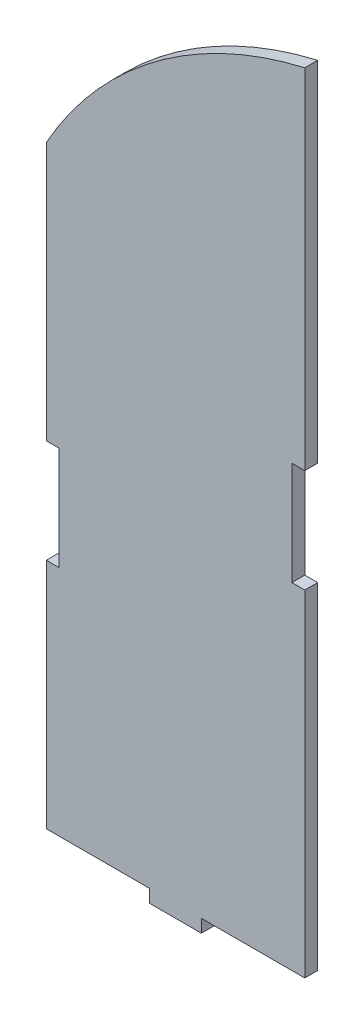
ISO-10303-21;
HEADER;
FILE_DESCRIPTION(('STEP AP214'),'2;1');
FILE_NAME('part.step','',(''),(''),'','','');
FILE_SCHEMA(('AUTOMOTIVE_DESIGN { 1 0 10303 214 1 1 1 1 }'));
ENDSEC;
DATA;
#1=APPLICATION_CONTEXT('core data for automotive mechanical design processes');
#2=APPLICATION_PROTOCOL_DEFINITION('international standard','automotive_design',2000,#1);
#3=PRODUCT_CONTEXT('',#1,'mechanical');
#4=PRODUCT('Part','Part','',(#3));
#5=PRODUCT_RELATED_PRODUCT_CATEGORY('part','',(#4));
#6=PRODUCT_DEFINITION_FORMATION('','',#4);
#7=PRODUCT_DEFINITION_CONTEXT('part definition',#1,'design');
#8=PRODUCT_DEFINITION('design','',#6,#7);
#9=PRODUCT_DEFINITION_SHAPE('','',#8);
#10=(LENGTH_UNIT() NAMED_UNIT(*) SI_UNIT(.MILLI.,.METRE.));
#11=(NAMED_UNIT(*) PLANE_ANGLE_UNIT() SI_UNIT($,.RADIAN.));
#12=(NAMED_UNIT(*) SI_UNIT($,.STERADIAN.) SOLID_ANGLE_UNIT());
#13=UNCERTAINTY_MEASURE_WITH_UNIT(LENGTH_MEASURE(1.E-05),#10,'distance_accuracy_value','');
#14=(GEOMETRIC_REPRESENTATION_CONTEXT(3) GLOBAL_UNCERTAINTY_ASSIGNED_CONTEXT((#13)) GLOBAL_UNIT_ASSIGNED_CONTEXT((#10,
#11,#12)) REPRESENTATION_CONTEXT('',''));
#15=CARTESIAN_POINT('',(0.,0.,0.));
#16=DIRECTION('',(0.,0.,1.));
#17=DIRECTION('',(1.,0.,0.));
#18=AXIS2_PLACEMENT_3D('',#15,#16,#17);
#19=CARTESIAN_POINT('',(99.9999999999915,315.707319284978,5.));
#20=DIRECTION('',(-1.,0.,0.));
#21=DIRECTION('',(0.,0.,1.));
#22=AXIS2_PLACEMENT_3D('',#19,#20,#21);
#23=PLANE('',#22);
#24=DIRECTION('',(0.,1.,0.));
#25=VECTOR('',#24,1.);
#26=CARTESIAN_POINT('',(99.9999999999915,315.707319284978,0.));
#27=LINE('',#26,#25);
#28=CARTESIAN_POINT('',(99.9999999999915,315.707319284978,0.));
#29=VERTEX_POINT('',#28);
#30=CARTESIAN_POINT('',(99.9999999999915,450.707319284978,0.));
#31=VERTEX_POINT('',#30);
#32=EDGE_CURVE('E179',#29,#31,#27,.T.);
#33=ORIENTED_EDGE('',*,*,#32,.T.);
#34=DIRECTION('',(0.,0.,-1.));
#35=VECTOR('',#34,1.);
#36=CARTESIAN_POINT('',(99.9999999999915,450.707319284978,5.));
#37=LINE('',#36,#35);
#38=CARTESIAN_POINT('',(99.9999999999915,450.707319284978,5.));
#39=VERTEX_POINT('',#38);
#40=EDGE_CURVE('E11',#39,#31,#37,.T.);
#41=ORIENTED_EDGE('',*,*,#40,.F.);
#42=DIRECTION('',(0.,1.,0.));
#43=VECTOR('',#42,1.);
#44=CARTESIAN_POINT('',(99.9999999999915,315.707319284978,5.));
#45=LINE('',#44,#43);
#46=CARTESIAN_POINT('',(99.9999999999915,315.707319284978,5.));
#47=VERTEX_POINT('',#46);
#48=EDGE_CURVE('E210',#47,#39,#45,.T.);
#49=ORIENTED_EDGE('',*,*,#48,.F.);
#50=DIRECTION('',(0.,0.,-1.));
#51=VECTOR('',#50,1.);
#52=CARTESIAN_POINT('',(99.9999999999915,315.707319284978,5.));
#53=LINE('',#52,#51);
#54=EDGE_CURVE('E175',#47,#29,#53,.T.);
#55=ORIENTED_EDGE('',*,*,#54,.T.);
#56=EDGE_LOOP('',(#33,#41,#49,#55));
#57=FACE_BOUND('',#56,.T.);
#58=ADVANCED_FACE('F35',(#57),#23,.F.);
#59=CARTESIAN_POINT('',(134.76828016419,300.182945732729,5.));
#60=DIRECTION('',(0.,0.,-1.));
#61=DIRECTION('',(-1.,0.,0.));
#62=AXIS2_PLACEMENT_3D('',#59,#60,#61);
#63=CYLINDRICAL_SURFACE('',#62,154.487605777529);
#64=CARTESIAN_POINT('',(134.76828016419,300.182945732729,0.));
#65=DIRECTION('',(0.,0.,1.));
#66=DIRECTION('',(-1.,0.,0.));
#67=AXIS2_PLACEMENT_3D('',#64,#65,#66);
#68=CIRCLE('',#67,154.487605777529);
#69=CARTESIAN_POINT('',(0.,375.707319284978,0.));
#70=VERTEX_POINT('',#69);
#71=EDGE_CURVE('E182',#31,#70,#68,.T.);
#72=ORIENTED_EDGE('',*,*,#71,.T.);
#73=DIRECTION('',(0.,0.,-1.));
#74=VECTOR('',#73,1.);
#75=CARTESIAN_POINT('',(0.,375.707319284978,5.));
#76=LINE('',#75,#74);
#77=CARTESIAN_POINT('',(0.,375.707319284978,5.));
#78=VERTEX_POINT('',#77);
#79=EDGE_CURVE('E43',#78,#70,#76,.T.);
#80=ORIENTED_EDGE('',*,*,#79,.F.);
#81=CARTESIAN_POINT('',(134.76828016419,300.182945732729,5.));
#82=DIRECTION('',(0.,0.,1.));
#83=DIRECTION('',(-1.,0.,0.));
#84=AXIS2_PLACEMENT_3D('',#81,#82,#83);
#85=CIRCLE('',#84,154.487605777529);
#86=EDGE_CURVE('E118',#39,#78,#85,.T.);
#87=ORIENTED_EDGE('',*,*,#86,.F.);
#88=ORIENTED_EDGE('',*,*,#40,.T.);
#89=EDGE_LOOP('',(#72,#80,#87,#88));
#90=FACE_BOUND('',#89,.T.);
#91=ADVANCED_FACE('F307',(#90),#63,.T.);
#92=CARTESIAN_POINT('',(0.,275.707319284978,5.));
#93=DIRECTION('',(1.,0.,0.));
#94=DIRECTION('',(0.,1.,0.));
#95=AXIS2_PLACEMENT_3D('',#92,#93,#94);
#96=PLANE('',#95);
#97=DIRECTION('',(0.,-1.,0.));
#98=VECTOR('',#97,1.);
#99=CARTESIAN_POINT('',(0.,275.707319284978,0.));
#100=LINE('',#99,#98);
#101=CARTESIAN_POINT('',(0.,275.707319284978,0.));
#102=VERTEX_POINT('',#101);
#103=EDGE_CURVE('E184',#70,#102,#100,.T.);
#104=ORIENTED_EDGE('',*,*,#103,.T.);
#105=DIRECTION('',(0.,0.,-1.));
#106=VECTOR('',#105,1.);
#107=CARTESIAN_POINT('',(0.,275.707319284978,5.));
#108=LINE('',#107,#106);
#109=CARTESIAN_POINT('',(0.,275.707319284978,5.));
#110=VERTEX_POINT('',#109);
#111=EDGE_CURVE('E241',#110,#102,#108,.T.);
#112=ORIENTED_EDGE('',*,*,#111,.F.);
#113=DIRECTION('',(0.,-1.,0.));
#114=VECTOR('',#113,1.);
#115=CARTESIAN_POINT('',(0.,275.707319284978,5.));
#116=LINE('',#115,#114);
#117=EDGE_CURVE('E249',#78,#110,#116,.T.);
#118=ORIENTED_EDGE('',*,*,#117,.F.);
#119=ORIENTED_EDGE('',*,*,#79,.T.);
#120=EDGE_LOOP('',(#104,#112,#118,#119));
#121=FACE_BOUND('',#120,.T.);
#122=ADVANCED_FACE('F247',(#121),#96,.F.);
#123=CARTESIAN_POINT('',(0.,275.707319284978,5.));
#124=DIRECTION('',(0.,1.,0.));
#125=DIRECTION('',(0.,0.,1.));
#126=AXIS2_PLACEMENT_3D('',#123,#124,#125);
#127=PLANE('',#126);
#128=DIRECTION('',(1.,0.,0.));
#129=VECTOR('',#128,1.);
#130=CARTESIAN_POINT('',(0.,275.707319284978,0.));
#131=LINE('',#130,#129);
#132=CARTESIAN_POINT('',(4.99999999999995,275.707319284978,0.));
#133=VERTEX_POINT('',#132);
#134=EDGE_CURVE('E186',#102,#133,#131,.T.);
#135=ORIENTED_EDGE('',*,*,#134,.T.);
#136=DIRECTION('',(0.,0.,-1.));
#137=VECTOR('',#136,1.);
#138=CARTESIAN_POINT('',(4.99999999999995,275.707319284978,5.));
#139=LINE('',#138,#137);
#140=CARTESIAN_POINT('',(4.99999999999995,275.707319284978,5.));
#141=VERTEX_POINT('',#140);
#142=EDGE_CURVE('E238',#141,#133,#139,.T.);
#143=ORIENTED_EDGE('',*,*,#142,.F.);
#144=DIRECTION('',(1.,0.,0.));
#145=VECTOR('',#144,1.);
#146=CARTESIAN_POINT('',(0.,275.707319284978,5.));
#147=LINE('',#146,#145);
#148=EDGE_CURVE('E267',#110,#141,#147,.T.);
#149=ORIENTED_EDGE('',*,*,#148,.F.);
#150=ORIENTED_EDGE('',*,*,#111,.T.);
#151=EDGE_LOOP('',(#135,#143,#149,#150));
#152=FACE_BOUND('',#151,.T.);
#153=ADVANCED_FACE('F258',(#152),#127,.F.);
#154=CARTESIAN_POINT('',(4.99999999999995,275.707319284978,5.));
#155=DIRECTION('',(1.,0.,0.));
#156=DIRECTION('',(0.,1.,0.));
#157=AXIS2_PLACEMENT_3D('',#154,#155,#156);
#158=PLANE('',#157);
#159=DIRECTION('',(0.,-1.,0.));
#160=VECTOR('',#159,1.);
#161=CARTESIAN_POINT('',(4.99999999999995,275.707319284978,0.));
#162=LINE('',#161,#160);
#163=CARTESIAN_POINT('',(4.99999999999997,235.707319284978,0.));
#164=VERTEX_POINT('',#163);
#165=EDGE_CURVE('E188',#133,#164,#162,.T.);
#166=ORIENTED_EDGE('',*,*,#165,.T.);
#167=DIRECTION('',(0.,0.,-1.));
#168=VECTOR('',#167,1.);
#169=CARTESIAN_POINT('',(4.99999999999997,235.707319284978,5.));
#170=LINE('',#169,#168);
#171=CARTESIAN_POINT('',(4.99999999999997,235.707319284978,5.));
#172=VERTEX_POINT('',#171);
#173=EDGE_CURVE('E235',#172,#164,#170,.T.);
#174=ORIENTED_EDGE('',*,*,#173,.F.);
#175=DIRECTION('',(0.,-1.,0.));
#176=VECTOR('',#175,1.);
#177=CARTESIAN_POINT('',(4.99999999999995,275.707319284978,5.));
#178=LINE('',#177,#176);
#179=EDGE_CURVE('E264',#141,#172,#178,.T.);
#180=ORIENTED_EDGE('',*,*,#179,.F.);
#181=ORIENTED_EDGE('',*,*,#142,.T.);
#182=EDGE_LOOP('',(#166,#174,#180,#181));
#183=FACE_BOUND('',#182,.T.);
#184=ADVANCED_FACE('F262',(#183),#158,.F.);
#185=CARTESIAN_POINT('',(4.99999999999997,235.707319284978,5.));
#186=DIRECTION('',(0.,-1.,0.));
#187=DIRECTION('',(0.,0.,-1.));
#188=AXIS2_PLACEMENT_3D('',#185,#186,#187);
#189=PLANE('',#188);
#190=DIRECTION('',(-1.,0.,0.));
#191=VECTOR('',#190,1.);
#192=CARTESIAN_POINT('',(4.99999999999997,235.707319284978,0.));
#193=LINE('',#192,#191);
#194=CARTESIAN_POINT('',(0.,235.707319284978,0.));
#195=VERTEX_POINT('',#194);
#196=EDGE_CURVE('E190',#164,#195,#193,.T.);
#197=ORIENTED_EDGE('',*,*,#196,.T.);
#198=DIRECTION('',(0.,0.,-1.));
#199=VECTOR('',#198,1.);
#200=CARTESIAN_POINT('',(0.,235.707319284978,5.));
#201=LINE('',#200,#199);
#202=CARTESIAN_POINT('',(0.,235.707319284978,5.));
#203=VERTEX_POINT('',#202);
#204=EDGE_CURVE('E232',#203,#195,#201,.T.);
#205=ORIENTED_EDGE('',*,*,#204,.F.);
#206=DIRECTION('',(-1.,0.,0.));
#207=VECTOR('',#206,1.);
#208=CARTESIAN_POINT('',(4.99999999999997,235.707319284978,5.));
#209=LINE('',#208,#207);
#210=EDGE_CURVE('E266',#172,#203,#209,.T.);
#211=ORIENTED_EDGE('',*,*,#210,.F.);
#212=ORIENTED_EDGE('',*,*,#173,.T.);
#213=EDGE_LOOP('',(#197,#205,#211,#212));
#214=FACE_BOUND('',#213,.T.);
#215=ADVANCED_FACE('F320',(#214),#189,.F.);
#216=CARTESIAN_POINT('',(0.,145.707319284978,5.));
#217=DIRECTION('',(1.,0.,0.));
#218=DIRECTION('',(0.,1.,0.));
#219=AXIS2_PLACEMENT_3D('',#216,#217,#218);
#220=PLANE('',#219);
#221=DIRECTION('',(0.,-1.,0.));
#222=VECTOR('',#221,1.);
#223=CARTESIAN_POINT('',(0.,145.707319284978,0.));
#224=LINE('',#223,#222);
#225=CARTESIAN_POINT('',(0.,145.707319284978,0.));
#226=VERTEX_POINT('',#225);
#227=EDGE_CURVE('E192',#195,#226,#224,.T.);
#228=ORIENTED_EDGE('',*,*,#227,.T.);
#229=DIRECTION('',(0.,0.,-1.));
#230=VECTOR('',#229,1.);
#231=CARTESIAN_POINT('',(0.,145.707319284978,5.));
#232=LINE('',#231,#230);
#233=CARTESIAN_POINT('',(0.,145.707319284978,5.));
#234=VERTEX_POINT('',#233);
#235=EDGE_CURVE('E229',#234,#226,#232,.T.);
#236=ORIENTED_EDGE('',*,*,#235,.F.);
#237=DIRECTION('',(0.,-1.,0.));
#238=VECTOR('',#237,1.);
#239=CARTESIAN_POINT('',(0.,145.707319284978,5.));
#240=LINE('',#239,#238);
#241=EDGE_CURVE('E269',#203,#234,#240,.T.);
#242=ORIENTED_EDGE('',*,*,#241,.F.);
#243=ORIENTED_EDGE('',*,*,#204,.T.);
#244=EDGE_LOOP('',(#228,#236,#242,#243));
#245=FACE_BOUND('',#244,.T.);
#246=ADVANCED_FACE('F323',(#245),#220,.F.);
#247=CARTESIAN_POINT('',(0.,145.707319284978,5.));
#248=DIRECTION('',(0.,1.,0.));
#249=DIRECTION('',(0.,0.,1.));
#250=AXIS2_PLACEMENT_3D('',#247,#248,#249);
#251=PLANE('',#250);
#252=DIRECTION('',(1.,0.,0.));
#253=VECTOR('',#252,1.);
#254=CARTESIAN_POINT('',(0.,145.707319284978,0.));
#255=LINE('',#254,#253);
#256=CARTESIAN_POINT('',(40.,145.707319284978,0.));
#257=VERTEX_POINT('',#256);
#258=EDGE_CURVE('E194',#226,#257,#255,.T.);
#259=ORIENTED_EDGE('',*,*,#258,.T.);
#260=DIRECTION('',(0.,0.,-1.));
#261=VECTOR('',#260,1.);
#262=CARTESIAN_POINT('',(40.,145.707319284978,5.));
#263=LINE('',#262,#261);
#264=CARTESIAN_POINT('',(40.,145.707319284978,5.));
#265=VERTEX_POINT('',#264);
#266=EDGE_CURVE('E226',#265,#257,#263,.T.);
#267=ORIENTED_EDGE('',*,*,#266,.F.);
#268=DIRECTION('',(1.,0.,0.));
#269=VECTOR('',#268,1.);
#270=CARTESIAN_POINT('',(0.,145.707319284978,5.));
#271=LINE('',#270,#269);
#272=EDGE_CURVE('E275',#234,#265,#271,.T.);
#273=ORIENTED_EDGE('',*,*,#272,.F.);
#274=ORIENTED_EDGE('',*,*,#235,.T.);
#275=EDGE_LOOP('',(#259,#267,#273,#274));
#276=FACE_BOUND('',#275,.T.);
#277=ADVANCED_FACE('F327',(#276),#251,.F.);
#278=CARTESIAN_POINT('',(40.,145.707319284978,5.));
#279=DIRECTION('',(1.,0.,0.));
#280=DIRECTION('',(0.,0.,-1.));
#281=AXIS2_PLACEMENT_3D('',#278,#279,#280);
#282=PLANE('',#281);
#283=DIRECTION('',(0.,-1.,0.));
#284=VECTOR('',#283,1.);
#285=CARTESIAN_POINT('',(40.,145.707319284978,0.));
#286=LINE('',#285,#284);
#287=CARTESIAN_POINT('',(40.,140.707319284978,0.));
#288=VERTEX_POINT('',#287);
#289=EDGE_CURVE('E196',#257,#288,#286,.T.);
#290=ORIENTED_EDGE('',*,*,#289,.T.);
#291=DIRECTION('',(0.,0.,-1.));
#292=VECTOR('',#291,1.);
#293=CARTESIAN_POINT('',(40.,140.707319284978,5.));
#294=LINE('',#293,#292);
#295=CARTESIAN_POINT('',(40.,140.707319284978,5.));
#296=VERTEX_POINT('',#295);
#297=EDGE_CURVE('E223',#296,#288,#294,.T.);
#298=ORIENTED_EDGE('',*,*,#297,.F.);
#299=DIRECTION('',(0.,-1.,0.));
#300=VECTOR('',#299,1.);
#301=CARTESIAN_POINT('',(40.,145.707319284978,5.));
#302=LINE('',#301,#300);
#303=EDGE_CURVE('E277',#265,#296,#302,.T.);
#304=ORIENTED_EDGE('',*,*,#303,.F.);
#305=ORIENTED_EDGE('',*,*,#266,.T.);
#306=EDGE_LOOP('',(#290,#298,#304,#305));
#307=FACE_BOUND('',#306,.T.);
#308=ADVANCED_FACE('F331',(#307),#282,.F.);
#309=CARTESIAN_POINT('',(40.,140.707319284978,5.));
#310=DIRECTION('',(0.,1.,0.));
#311=DIRECTION('',(0.,0.,1.));
#312=AXIS2_PLACEMENT_3D('',#309,#310,#311);
#313=PLANE('',#312);
#314=DIRECTION('',(1.,0.,0.));
#315=VECTOR('',#314,1.);
#316=CARTESIAN_POINT('',(40.,140.707319284978,0.));
#317=LINE('',#316,#315);
#318=CARTESIAN_POINT('',(60.,140.707319284978,0.));
#319=VERTEX_POINT('',#318);
#320=EDGE_CURVE('E198',#288,#319,#317,.T.);
#321=ORIENTED_EDGE('',*,*,#320,.T.);
#322=DIRECTION('',(0.,0.,-1.));
#323=VECTOR('',#322,1.);
#324=CARTESIAN_POINT('',(60.,140.707319284978,5.));
#325=LINE('',#324,#323);
#326=CARTESIAN_POINT('',(60.,140.707319284978,5.));
#327=VERTEX_POINT('',#326);
#328=EDGE_CURVE('E220',#327,#319,#325,.T.);
#329=ORIENTED_EDGE('',*,*,#328,.F.);
#330=DIRECTION('',(1.,0.,0.));
#331=VECTOR('',#330,1.);
#332=CARTESIAN_POINT('',(40.,140.707319284978,5.));
#333=LINE('',#332,#331);
#334=EDGE_CURVE('E279',#296,#327,#333,.T.);
#335=ORIENTED_EDGE('',*,*,#334,.F.);
#336=ORIENTED_EDGE('',*,*,#297,.T.);
#337=EDGE_LOOP('',(#321,#329,#335,#336));
#338=FACE_BOUND('',#337,.T.);
#339=ADVANCED_FACE('F335',(#338),#313,.F.);
#340=CARTESIAN_POINT('',(60.,140.707319284978,5.));
#341=DIRECTION('',(-1.,0.,0.));
#342=DIRECTION('',(0.,0.,1.));
#343=AXIS2_PLACEMENT_3D('',#340,#341,#342);
#344=PLANE('',#343);
#345=DIRECTION('',(0.,1.,0.));
#346=VECTOR('',#345,1.);
#347=CARTESIAN_POINT('',(60.,140.707319284978,0.));
#348=LINE('',#347,#346);
#349=CARTESIAN_POINT('',(60.,145.707319284978,0.));
#350=VERTEX_POINT('',#349);
#351=EDGE_CURVE('E200',#319,#350,#348,.T.);
#352=ORIENTED_EDGE('',*,*,#351,.T.);
#353=DIRECTION('',(0.,0.,-1.));
#354=VECTOR('',#353,1.);
#355=CARTESIAN_POINT('',(60.,145.707319284978,5.));
#356=LINE('',#355,#354);
#357=CARTESIAN_POINT('',(60.,145.707319284978,5.));
#358=VERTEX_POINT('',#357);
#359=EDGE_CURVE('E217',#358,#350,#356,.T.);
#360=ORIENTED_EDGE('',*,*,#359,.F.);
#361=DIRECTION('',(0.,1.,0.));
#362=VECTOR('',#361,1.);
#363=CARTESIAN_POINT('',(60.,140.707319284978,5.));
#364=LINE('',#363,#362);
#365=EDGE_CURVE('E281',#327,#358,#364,.T.);
#366=ORIENTED_EDGE('',*,*,#365,.F.);
#367=ORIENTED_EDGE('',*,*,#328,.T.);
#368=EDGE_LOOP('',(#352,#360,#366,#367));
#369=FACE_BOUND('',#368,.T.);
#370=ADVANCED_FACE('F339',(#369),#344,.F.);
#371=CARTESIAN_POINT('',(60.,145.707319284978,5.));
#372=DIRECTION('',(0.,1.,0.));
#373=DIRECTION('',(0.,0.,1.));
#374=AXIS2_PLACEMENT_3D('',#371,#372,#373);
#375=PLANE('',#374);
#376=DIRECTION('',(1.,0.,0.));
#377=VECTOR('',#376,1.);
#378=CARTESIAN_POINT('',(60.,145.707319284978,0.));
#379=LINE('',#378,#377);
#380=CARTESIAN_POINT('',(99.9999999999915,145.707319284978,0.));
#381=VERTEX_POINT('',#380);
#382=EDGE_CURVE('E202',#350,#381,#379,.T.);
#383=ORIENTED_EDGE('',*,*,#382,.T.);
#384=DIRECTION('',(0.,0.,-1.));
#385=VECTOR('',#384,1.);
#386=CARTESIAN_POINT('',(99.9999999999915,145.707319284978,5.));
#387=LINE('',#386,#385);
#388=CARTESIAN_POINT('',(99.9999999999915,145.707319284978,5.));
#389=VERTEX_POINT('',#388);
#390=EDGE_CURVE('E214',#389,#381,#387,.T.);
#391=ORIENTED_EDGE('',*,*,#390,.F.);
#392=DIRECTION('',(1.,0.,0.));
#393=VECTOR('',#392,1.);
#394=CARTESIAN_POINT('',(60.,145.707319284978,5.));
#395=LINE('',#394,#393);
#396=EDGE_CURVE('E283',#358,#389,#395,.T.);
#397=ORIENTED_EDGE('',*,*,#396,.F.);
#398=ORIENTED_EDGE('',*,*,#359,.T.);
#399=EDGE_LOOP('',(#383,#391,#397,#398));
#400=FACE_BOUND('',#399,.T.);
#401=ADVANCED_FACE('F289',(#400),#375,.F.);
#402=CARTESIAN_POINT('',(99.9999999999915,275.707319284978,5.));
#403=DIRECTION('',(-1.,0.,0.));
#404=DIRECTION('',(0.,0.,1.));
#405=AXIS2_PLACEMENT_3D('',#402,#403,#404);
#406=PLANE('',#405);
#407=DIRECTION('',(0.,1.,0.));
#408=VECTOR('',#407,1.);
#409=CARTESIAN_POINT('',(99.9999999999915,275.707319284978,0.));
#410=LINE('',#409,#408);
#411=CARTESIAN_POINT('',(99.9999999999915,275.707319284978,0.));
#412=VERTEX_POINT('',#411);
#413=EDGE_CURVE('E205',#381,#412,#410,.T.);
#414=ORIENTED_EDGE('',*,*,#413,.T.);
#415=DIRECTION('',(0.,0.,-1.));
#416=VECTOR('',#415,1.);
#417=CARTESIAN_POINT('',(99.9999999999915,275.707319284978,5.));
#418=LINE('',#417,#416);
#419=CARTESIAN_POINT('',(99.9999999999915,275.707319284978,5.));
#420=VERTEX_POINT('',#419);
#421=EDGE_CURVE('E170',#420,#412,#418,.T.);
#422=ORIENTED_EDGE('',*,*,#421,.F.);
#423=DIRECTION('',(0.,1.,0.));
#424=VECTOR('',#423,1.);
#425=CARTESIAN_POINT('',(99.9999999999915,145.707319284978,5.));
#426=LINE('',#425,#424);
#427=EDGE_CURVE('E161',#389,#420,#426,.T.);
#428=ORIENTED_EDGE('',*,*,#427,.F.);
#429=ORIENTED_EDGE('',*,*,#390,.T.);
#430=EDGE_LOOP('',(#414,#422,#428,#429));
#431=FACE_BOUND('',#430,.T.);
#432=ADVANCED_FACE('F292',(#431),#406,.F.);
#433=CARTESIAN_POINT('',(94.9999999999915,275.707319284978,5.));
#434=DIRECTION('',(0.,-1.,0.));
#435=DIRECTION('',(0.,0.,-1.));
#436=AXIS2_PLACEMENT_3D('',#433,#434,#435);
#437=PLANE('',#436);
#438=DIRECTION('',(-1.,0.,0.));
#439=VECTOR('',#438,1.);
#440=CARTESIAN_POINT('',(94.9999999999915,275.707319284978,0.));
#441=LINE('',#440,#439);
#442=CARTESIAN_POINT('',(94.9999999999915,275.707319284978,0.));
#443=VERTEX_POINT('',#442);
#444=EDGE_CURVE('E169',#412,#443,#441,.T.);
#445=ORIENTED_EDGE('',*,*,#444,.T.);
#446=DIRECTION('',(0.,0.,-1.));
#447=VECTOR('',#446,1.);
#448=CARTESIAN_POINT('',(94.9999999999915,275.707319284978,5.));
#449=LINE('',#448,#447);
#450=CARTESIAN_POINT('',(94.9999999999915,275.707319284978,5.));
#451=VERTEX_POINT('',#450);
#452=EDGE_CURVE('E166',#451,#443,#449,.T.);
#453=ORIENTED_EDGE('',*,*,#452,.F.);
#454=DIRECTION('',(-1.,0.,0.));
#455=VECTOR('',#454,1.);
#456=CARTESIAN_POINT('',(94.9999999999915,275.707319284978,5.));
#457=LINE('',#456,#455);
#458=EDGE_CURVE('E155',#420,#451,#457,.T.);
#459=ORIENTED_EDGE('',*,*,#458,.F.);
#460=ORIENTED_EDGE('',*,*,#421,.T.);
#461=EDGE_LOOP('',(#445,#453,#459,#460));
#462=FACE_BOUND('',#461,.T.);
#463=ADVANCED_FACE('F167',(#462),#437,.F.);
#464=CARTESIAN_POINT('',(94.9999999999915,315.707319284978,5.));
#465=DIRECTION('',(-1.,0.,0.));
#466=DIRECTION('',(0.,0.,1.));
#467=AXIS2_PLACEMENT_3D('',#464,#465,#466);
#468=PLANE('',#467);
#469=DIRECTION('',(0.,1.,0.));
#470=VECTOR('',#469,1.);
#471=CARTESIAN_POINT('',(94.9999999999915,315.707319284978,0.));
#472=LINE('',#471,#470);
#473=CARTESIAN_POINT('',(94.9999999999915,315.707319284978,0.));
#474=VERTEX_POINT('',#473);
#475=EDGE_CURVE('E104',#443,#474,#472,.T.);
#476=ORIENTED_EDGE('',*,*,#475,.T.);
#477=DIRECTION('',(0.,0.,-1.));
#478=VECTOR('',#477,1.);
#479=CARTESIAN_POINT('',(94.9999999999915,315.707319284978,5.));
#480=LINE('',#479,#478);
#481=CARTESIAN_POINT('',(94.9999999999915,315.707319284978,5.));
#482=VERTEX_POINT('',#481);
#483=EDGE_CURVE('E171',#482,#474,#480,.T.);
#484=ORIENTED_EDGE('',*,*,#483,.F.);
#485=DIRECTION('',(0.,1.,0.));
#486=VECTOR('',#485,1.);
#487=CARTESIAN_POINT('',(94.9999999999915,315.707319284978,5.));
#488=LINE('',#487,#486);
#489=EDGE_CURVE('E159',#451,#482,#488,.T.);
#490=ORIENTED_EDGE('',*,*,#489,.F.);
#491=ORIENTED_EDGE('',*,*,#452,.T.);
#492=EDGE_LOOP('',(#476,#484,#490,#491));
#493=FACE_BOUND('',#492,.T.);
#494=ADVANCED_FACE('F173',(#493),#468,.F.);
#495=CARTESIAN_POINT('',(99.9999999999915,315.707319284978,5.));
#496=DIRECTION('',(0.,1.,0.));
#497=DIRECTION('',(0.,0.,1.));
#498=AXIS2_PLACEMENT_3D('',#495,#496,#497);
#499=PLANE('',#498);
#500=DIRECTION('',(1.,0.,0.));
#501=VECTOR('',#500,1.);
#502=CARTESIAN_POINT('',(99.9999999999915,315.707319284978,0.));
#503=LINE('',#502,#501);
#504=EDGE_CURVE('E110',#474,#29,#503,.T.);
#505=ORIENTED_EDGE('',*,*,#504,.T.);
#506=ORIENTED_EDGE('',*,*,#54,.F.);
#507=DIRECTION('',(1.,0.,0.));
#508=VECTOR('',#507,1.);
#509=CARTESIAN_POINT('',(99.9999999999915,315.707319284978,5.));
#510=LINE('',#509,#508);
#511=EDGE_CURVE('E51',#482,#47,#510,.T.);
#512=ORIENTED_EDGE('',*,*,#511,.F.);
#513=ORIENTED_EDGE('',*,*,#483,.T.);
#514=EDGE_LOOP('',(#505,#506,#512,#513));
#515=FACE_BOUND('',#514,.T.);
#516=ADVANCED_FACE('F296',(#515),#499,.F.);
#517=CARTESIAN_POINT('',(134.76828016419,300.182945732729,5.));
#518=DIRECTION('',(0.,0.,-1.));
#519=DIRECTION('',(-1.,0.,0.));
#520=AXIS2_PLACEMENT_3D('',#517,#518,#519);
#521=PLANE('',#520);
#522=ORIENTED_EDGE('',*,*,#48,.T.);
#523=ORIENTED_EDGE('',*,*,#86,.T.);
#524=ORIENTED_EDGE('',*,*,#117,.T.);
#525=ORIENTED_EDGE('',*,*,#148,.T.);
#526=ORIENTED_EDGE('',*,*,#179,.T.);
#527=ORIENTED_EDGE('',*,*,#210,.T.);
#528=ORIENTED_EDGE('',*,*,#241,.T.);
#529=ORIENTED_EDGE('',*,*,#272,.T.);
#530=ORIENTED_EDGE('',*,*,#303,.T.);
#531=ORIENTED_EDGE('',*,*,#334,.T.);
#532=ORIENTED_EDGE('',*,*,#365,.T.);
#533=ORIENTED_EDGE('',*,*,#396,.T.);
#534=ORIENTED_EDGE('',*,*,#427,.T.);
#535=ORIENTED_EDGE('',*,*,#458,.T.);
#536=ORIENTED_EDGE('',*,*,#489,.T.);
#537=ORIENTED_EDGE('',*,*,#511,.T.);
#538=EDGE_LOOP('',(#522,#523,#524,#525,#526,#527,#528,#529,#530,#531,#532,#533,#534,#535,#536,#537));
#539=FACE_BOUND('',#538,.T.);
#540=ADVANCED_FACE('F157',(#539),#521,.F.);
#541=CARTESIAN_POINT('',(134.76828016419,300.182945732729,0.));
#542=DIRECTION('',(0.,0.,-1.));
#543=DIRECTION('',(-1.,0.,0.));
#544=AXIS2_PLACEMENT_3D('',#541,#542,#543);
#545=PLANE('',#544);
#546=ORIENTED_EDGE('',*,*,#32,.F.);
#547=ORIENTED_EDGE('',*,*,#504,.F.);
#548=ORIENTED_EDGE('',*,*,#475,.F.);
#549=ORIENTED_EDGE('',*,*,#444,.F.);
#550=ORIENTED_EDGE('',*,*,#413,.F.);
#551=ORIENTED_EDGE('',*,*,#382,.F.);
#552=ORIENTED_EDGE('',*,*,#351,.F.);
#553=ORIENTED_EDGE('',*,*,#320,.F.);
#554=ORIENTED_EDGE('',*,*,#289,.F.);
#555=ORIENTED_EDGE('',*,*,#258,.F.);
#556=ORIENTED_EDGE('',*,*,#227,.F.);
#557=ORIENTED_EDGE('',*,*,#196,.F.);
#558=ORIENTED_EDGE('',*,*,#165,.F.);
#559=ORIENTED_EDGE('',*,*,#134,.F.);
#560=ORIENTED_EDGE('',*,*,#103,.F.);
#561=ORIENTED_EDGE('',*,*,#71,.F.);
#562=EDGE_LOOP('',(#546,#547,#548,#549,#550,#551,#552,#553,#554,#555,#556,#557,#558,#559,#560,#561));
#563=FACE_BOUND('',#562,.T.);
#564=ADVANCED_FACE('F253',(#563),#545,.T.);
#565=CLOSED_SHELL('',(#58,#91,#122,#153,#184,#215,#246,#277,#308,#339,#370,#401,#432,#463,#494,
#516,#540,#564));
#566=MANIFOLD_SOLID_BREP('B2',#565);
#567=ADVANCED_BREP_SHAPE_REPRESENTATION('',(#18,#566),#14);
#568=SHAPE_DEFINITION_REPRESENTATION(#9,#567);
ENDSEC;
END-ISO-10303-21;
